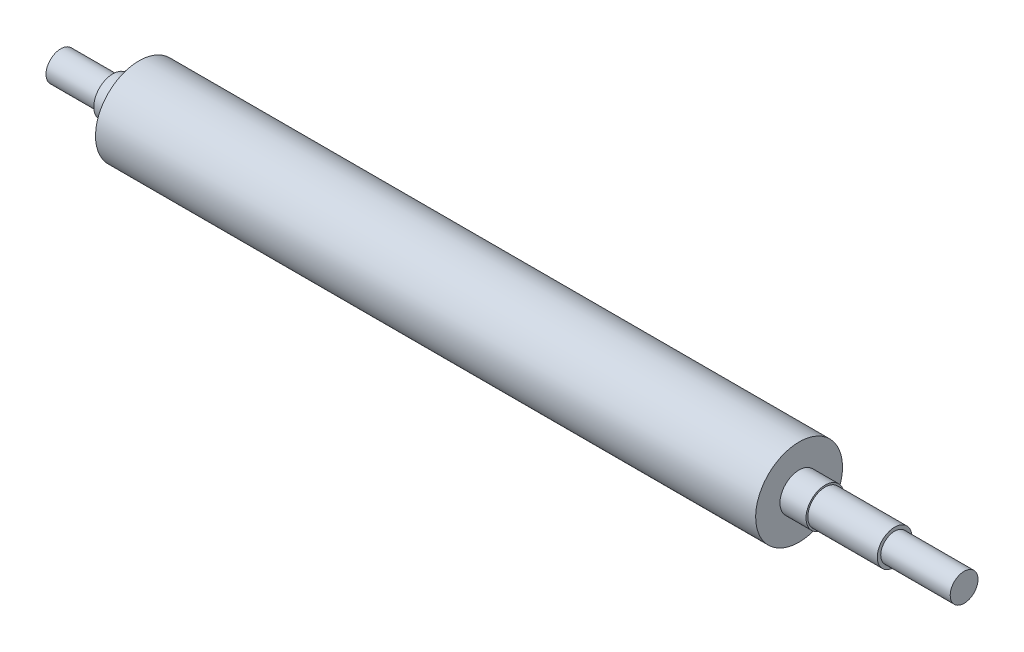
ISO-10303-21;
HEADER;
FILE_DESCRIPTION(('STEP AP214'),'2;1');
FILE_NAME('part.step','',(''),(''),'','','');
FILE_SCHEMA(('AUTOMOTIVE_DESIGN { 1 0 10303 214 1 1 1 1 }'));
ENDSEC;
DATA;
#1=APPLICATION_CONTEXT('core data for automotive mechanical design processes');
#2=APPLICATION_PROTOCOL_DEFINITION('international standard','automotive_design',2000,#1);
#3=PRODUCT_CONTEXT('',#1,'mechanical');
#4=PRODUCT('Part','Part','',(#3));
#5=PRODUCT_RELATED_PRODUCT_CATEGORY('part','',(#4));
#6=PRODUCT_DEFINITION_FORMATION('','',#4);
#7=PRODUCT_DEFINITION_CONTEXT('part definition',#1,'design');
#8=PRODUCT_DEFINITION('design','',#6,#7);
#9=PRODUCT_DEFINITION_SHAPE('','',#8);
#10=(LENGTH_UNIT() NAMED_UNIT(*) SI_UNIT(.MILLI.,.METRE.));
#11=(NAMED_UNIT(*) PLANE_ANGLE_UNIT() SI_UNIT($,.RADIAN.));
#12=(NAMED_UNIT(*) SI_UNIT($,.STERADIAN.) SOLID_ANGLE_UNIT());
#13=UNCERTAINTY_MEASURE_WITH_UNIT(LENGTH_MEASURE(1.E-05),#10,'distance_accuracy_value','');
#14=(GEOMETRIC_REPRESENTATION_CONTEXT(3) GLOBAL_UNCERTAINTY_ASSIGNED_CONTEXT((#13)) GLOBAL_UNIT_ASSIGNED_CONTEXT((#10,
#11,#12)) REPRESENTATION_CONTEXT('',''));
#15=CARTESIAN_POINT('',(0.,0.,0.));
#16=DIRECTION('',(0.,0.,1.));
#17=DIRECTION('',(1.,0.,0.));
#18=AXIS2_PLACEMENT_3D('',#15,#16,#17);
#19=CARTESIAN_POINT('',(-235.,0.,0.));
#20=DIRECTION('',(-1.,0.,0.));
#21=DIRECTION('',(0.,-1.,0.));
#22=AXIS2_PLACEMENT_3D('',#19,#20,#21);
#23=CYLINDRICAL_SURFACE('',#22,10.0000000000001);
#24=CARTESIAN_POINT('',(205.,0.,0.));
#25=DIRECTION('',(-1.,0.,0.));
#26=DIRECTION('',(0.,-1.,0.));
#27=AXIS2_PLACEMENT_3D('',#24,#25,#26);
#28=CIRCLE('',#27,10.0000000000001);
#29=CARTESIAN_POINT('',(205.,-10.0000000000001,0.));
#30=VERTEX_POINT('',#29);
#31=EDGE_CURVE('E110',#30,#30,#28,.T.);
#32=ORIENTED_EDGE('',*,*,#31,.F.);
#33=EDGE_LOOP('',(#32));
#34=FACE_BOUND('',#33,.T.);
#35=CARTESIAN_POINT('',(245.,0.,0.));
#36=DIRECTION('',(-1.,0.,0.));
#37=DIRECTION('',(0.,-1.,0.));
#38=AXIS2_PLACEMENT_3D('',#35,#36,#37);
#39=CIRCLE('',#38,10.0000000000001);
#40=CARTESIAN_POINT('',(245.,-10.0000000000001,0.));
#41=VERTEX_POINT('',#40);
#42=EDGE_CURVE('E159',#41,#41,#39,.T.);
#43=ORIENTED_EDGE('',*,*,#42,.T.);
#44=EDGE_LOOP('',(#43));
#45=FACE_BOUND('',#44,.T.);
#46=ADVANCED_FACE('F39',(#34,#45),#23,.T.);
#47=CARTESIAN_POINT('',(245.,10.0000000000001,0.));
#48=DIRECTION('',(-1.,0.,0.));
#49=DIRECTION('',(0.,-1.,0.));
#50=AXIS2_PLACEMENT_3D('',#47,#48,#49);
#51=PLANE('',#50);
#52=ORIENTED_EDGE('',*,*,#42,.F.);
#53=EDGE_LOOP('',(#52));
#54=FACE_BOUND('',#53,.T.);
#55=CARTESIAN_POINT('',(245.,0.,0.));
#56=DIRECTION('',(-1.,0.,0.));
#57=DIRECTION('',(0.,-1.,0.));
#58=AXIS2_PLACEMENT_3D('',#55,#56,#57);
#59=CIRCLE('',#58,8.);
#60=CARTESIAN_POINT('',(245.,-8.,0.));
#61=VERTEX_POINT('',#60);
#62=EDGE_CURVE('E155',#61,#61,#59,.T.);
#63=ORIENTED_EDGE('',*,*,#62,.T.);
#64=EDGE_LOOP('',(#63));
#65=FACE_BOUND('',#64,.T.);
#66=ADVANCED_FACE('F234',(#54,#65),#51,.F.);
#67=CARTESIAN_POINT('',(-235.,0.,0.));
#68=DIRECTION('',(-1.,0.,0.));
#69=DIRECTION('',(0.,-1.,0.));
#70=AXIS2_PLACEMENT_3D('',#67,#68,#69);
#71=CYLINDRICAL_SURFACE('',#70,8.);
#72=DIRECTION('',(-1.,0.,0.));
#73=VECTOR('',#72,1.);
#74=CARTESIAN_POINT('',(-235.,-7.41619848709564,-3.00000000000006));
#75=LINE('',#74,#73);
#76=CARTESIAN_POINT('',(250.,-7.41619848709564,-3.00000000000006));
#77=VERTEX_POINT('',#76);
#78=CARTESIAN_POINT('',(280.,-7.41619848709564,-3.00000000000006));
#79=VERTEX_POINT('',#78);
#80=EDGE_CURVE('E11',#77,#79,#75,.F.);
#81=ORIENTED_EDGE('',*,*,#80,.F.);
#82=CARTESIAN_POINT('',(250.,-7.41619848709564,-3.00000000000006));
#83=CARTESIAN_POINT('',(249.918837555012,-7.41618329421385,-3.00001150247647));
#84=CARTESIAN_POINT('',(249.837683450061,-7.41753047889668,-2.9967066173563));
#85=CARTESIAN_POINT('',(249.676019617705,-7.42283625204764,-2.98355385410622));
#86=CARTESIAN_POINT('',(249.595509683128,-7.42679396371771,-2.97370817282648));
#87=CARTESIAN_POINT('',(249.435989649364,-7.43718913494997,-2.9476097988831));
#88=CARTESIAN_POINT('',(249.356975247266,-7.44361776009883,-2.93137992723333));
#89=CARTESIAN_POINT('',(249.20072757264,-7.45873846840474,-2.89268899794152));
#90=CARTESIAN_POINT('',(249.123494390916,-7.4674306666777,-2.87022762338739));
#91=CARTESIAN_POINT('',(248.895386572167,-7.49650104432072,-2.79382748302793));
#92=CARTESIAN_POINT('',(248.747818987316,-7.51989303640962,-2.73082546455872));
#93=CARTESIAN_POINT('',(248.465300287699,-7.57204865479854,-2.58267582298611));
#94=CARTESIAN_POINT('',(248.330359622463,-7.60081667210071,-2.49751007462128));
#95=CARTESIAN_POINT('',(248.070225495052,-7.66207154206043,-2.30293382930718));
#96=CARTESIAN_POINT('',(247.945742475663,-7.69466741280603,-2.19260586782626));
#97=CARTESIAN_POINT('',(247.716550309181,-7.75899570966099,-1.9527886998884));
#98=CARTESIAN_POINT('',(247.611844989759,-7.7907279676163,-1.82329579298122));
#99=CARTESIAN_POINT('',(247.421720276261,-7.85105785862139,-1.54338757171277));
#100=CARTESIAN_POINT('',(247.337078987434,-7.87951196244674,-1.39240997283595));
#101=CARTESIAN_POINT('',(247.194695989104,-7.92876071159695,-1.07710720930449));
#102=CARTESIAN_POINT('',(247.136944250488,-7.94955821203215,-0.912787047982235));
#103=CARTESIAN_POINT('',(247.052484610716,-7.98037380796759,-0.58298011001187));
#104=CARTESIAN_POINT('',(247.024545247854,-7.99081812162104,-0.417849300032766));
#105=CARTESIAN_POINT('',(246.996557587679,-8.00128028076469,-0.0849316755534519));
#106=CARTESIAN_POINT('',(246.996500708907,-8.0013013342463,0.0828543058596256));
#107=CARTESIAN_POINT('',(247.023563629082,-7.99118528299379,0.40748820226102));
#108=CARTESIAN_POINT('',(247.049339000397,-7.98155070187544,0.56446657549835));
#109=CARTESIAN_POINT('',(247.125072492239,-7.95386524687798,0.871680542257373));
#110=CARTESIAN_POINT('',(247.175031985972,-7.93581389508571,1.02191575236401));
#111=CARTESIAN_POINT('',(247.298340971181,-7.89275540648328,1.31397787173874));
#112=CARTESIAN_POINT('',(247.372020379767,-7.86765083491918,1.45565053647599));
#113=CARTESIAN_POINT('',(247.540383376999,-7.8130263042928,1.72497274825266));
#114=CARTESIAN_POINT('',(247.635073796639,-7.78350491027406,1.85261771444891));
#115=CARTESIAN_POINT('',(247.849249022252,-7.72105277880022,2.0981725570586));
#116=CARTESIAN_POINT('',(247.9698593461,-7.68802362154427,2.21507771422329));
#117=CARTESIAN_POINT('',(248.229157687177,-7.62365399937982,2.42739237334714));
#118=CARTESIAN_POINT('',(248.367852776117,-7.59231420187513,2.5227934265));
#119=CARTESIAN_POINT('',(248.663556528403,-7.53423615367639,2.69136811228862));
#120=CARTESIAN_POINT('',(248.820909467739,-7.50761852023582,2.76398796570966));
#121=CARTESIAN_POINT('',(249.065094258959,-7.47445645209121,2.85192253834707));
#122=CARTESIAN_POINT('',(249.147830051979,-7.46453121139932,2.87773161974411));
#123=CARTESIAN_POINT('',(249.315465728326,-7.44725807921767,2.92214252998083));
#124=CARTESIAN_POINT('',(249.400364616494,-7.43990902469482,2.94074761150273));
#125=CARTESIAN_POINT('',(249.570735262701,-7.42813167576347,2.97037457126441));
#126=CARTESIAN_POINT('',(249.656191278976,-7.42367309574557,2.98147513434601));
#127=CARTESIAN_POINT('',(249.827761505356,-7.41769829849116,2.99629160882997));
#128=CARTESIAN_POINT('',(249.913875028841,-7.41617934660601,3.00001438364694));
#129=CARTESIAN_POINT('',(250.,-7.41619848709569,2.99999999999994));
#130=B_SPLINE_CURVE_WITH_KNOTS('',3,(#82,#83,#84,#85,#86,#87,#88,#89,#90,#91,#92,#93,#94,#95,
#96,#97,#98,#99,#100,#101,#102,#103,#104,#105,#106,#107,#108,#109,#110,#111,#112,#113,#114,#115,
#116,#117,#118,#119,#120,#121,#122,#123,#124,#125,#126,#127,#128,#129),.UNSPECIFIED.,.F.,.F.,(4,
2,2,2,2,2,2,2,2,2,2,2,2,2,2,2,2,2,2,2,2,2,2,4),(0.,0.243394931332342,0.486708155172818,
0.729159418642507,0.971623014582996,1.45569332924433,1.94016076226286,2.44639743378841,
2.95273197950298,3.47630767422024,3.9996879318651,4.50049538938436,5.00114871211392,
5.47703219828147,5.95294270890935,6.43578138823395,6.91877727629378,7.42999676443292,
7.94141675825194,8.46444709431861,8.72585166683365,8.98713807440332,9.24564054700924,
9.5039024266378),.UNSPECIFIED.);
#131=CARTESIAN_POINT('',(250.,-7.41619848709569,2.99999999999994));
#132=VERTEX_POINT('',#131);
#133=EDGE_CURVE('E163',#77,#132,#130,.T.);
#134=ORIENTED_EDGE('',*,*,#133,.T.);
#135=DIRECTION('',(-1.,0.,0.));
#136=VECTOR('',#135,1.);
#137=CARTESIAN_POINT('',(-235.,-7.41619848709569,2.99999999999994));
#138=LINE('',#137,#136);
#139=CARTESIAN_POINT('',(280.,-7.41619848709569,2.99999999999994));
#140=VERTEX_POINT('',#139);
#141=EDGE_CURVE('E47',#132,#140,#138,.F.);
#142=ORIENTED_EDGE('',*,*,#141,.T.);
#143=CARTESIAN_POINT('',(280.,-7.41619848709569,2.99999999999994));
#144=CARTESIAN_POINT('',(280.081162444988,-7.4161832942139,3.00001150247634));
#145=CARTESIAN_POINT('',(280.162316549939,-7.41753047889673,2.99670661735617));
#146=CARTESIAN_POINT('',(280.323980382295,-7.42283625204769,2.98355385410609));
#147=CARTESIAN_POINT('',(280.404490316872,-7.42679396371776,2.97370817282636));
#148=CARTESIAN_POINT('',(280.564010350636,-7.43718913495002,2.94760979888298));
#149=CARTESIAN_POINT('',(280.643024752734,-7.44361776009888,2.9313799272332));
#150=CARTESIAN_POINT('',(280.79927242736,-7.45873846840479,2.89268899794139));
#151=CARTESIAN_POINT('',(280.876505609084,-7.46743066667775,2.87022762338725));
#152=CARTESIAN_POINT('',(281.104613427834,-7.49650104432077,2.79382748302779));
#153=CARTESIAN_POINT('',(281.252181012685,-7.51989303640967,2.73082546455858));
#154=CARTESIAN_POINT('',(281.534699712301,-7.57204865479859,2.58267582298596));
#155=CARTESIAN_POINT('',(281.669640377537,-7.60081667210076,2.49751007462113));
#156=CARTESIAN_POINT('',(281.929774504948,-7.66207154206048,2.30293382930703));
#157=CARTESIAN_POINT('',(282.054257524337,-7.69466741280606,2.19260586782613));
#158=CARTESIAN_POINT('',(282.283449690819,-7.75899570966102,1.95278869988827));
#159=CARTESIAN_POINT('',(282.388155010241,-7.79072796761634,1.82329579298109));
#160=CARTESIAN_POINT('',(282.578279723739,-7.85105785862142,1.54338757171262));
#161=CARTESIAN_POINT('',(282.662921012567,-7.87951196244676,1.39240997283579));
#162=CARTESIAN_POINT('',(282.805304010896,-7.92876071159697,1.07710720930432));
#163=CARTESIAN_POINT('',(282.863055749512,-7.94955821203217,0.91278704798206));
#164=CARTESIAN_POINT('',(282.947515389284,-7.98037380796761,0.582980110011687));
#165=CARTESIAN_POINT('',(282.975454752146,-7.99081812162105,0.417849300032584));
#166=CARTESIAN_POINT('',(283.003442412321,-8.00128028076469,0.0849316755532768));
#167=CARTESIAN_POINT('',(283.003499291093,-8.0013013342463,-0.0828543058597944));
#168=CARTESIAN_POINT('',(282.976436370918,-7.99118528299379,-0.407488202261183));
#169=CARTESIAN_POINT('',(282.950660999603,-7.98155070187543,-0.564466575498514));
#170=CARTESIAN_POINT('',(282.874927507761,-7.95386524687796,-0.871680542257533));
#171=CARTESIAN_POINT('',(282.824968014028,-7.93581389508569,-1.02191575236417));
#172=CARTESIAN_POINT('',(282.701659028819,-7.89275540648325,-1.31397787173889));
#173=CARTESIAN_POINT('',(282.627979620233,-7.86765083491915,-1.45565053647615));
#174=CARTESIAN_POINT('',(282.459616623001,-7.81302630429277,-1.72497274825282));
#175=CARTESIAN_POINT('',(282.36492620336,-7.78350491027402,-1.85261771444908));
#176=CARTESIAN_POINT('',(282.150750977748,-7.72105277880018,-2.09817255705875));
#177=CARTESIAN_POINT('',(282.0301406539,-7.68802362154422,-2.21507771422343));
#178=CARTESIAN_POINT('',(281.770842312823,-7.62365399937977,-2.42739237334728));
#179=CARTESIAN_POINT('',(281.632147223883,-7.59231420187509,-2.52279342650013));
#180=CARTESIAN_POINT('',(281.336443471597,-7.53423615367635,-2.69136811228875));
#181=CARTESIAN_POINT('',(281.179090532261,-7.50761852023577,-2.7639879657098));
#182=CARTESIAN_POINT('',(280.934905741041,-7.47445645209116,-2.85192253834722));
#183=CARTESIAN_POINT('',(280.852169948021,-7.46453121139927,-2.87773161974426));
#184=CARTESIAN_POINT('',(280.684534271674,-7.44725807921762,-2.92214252998097));
#185=CARTESIAN_POINT('',(280.599635383506,-7.43990902469476,-2.94074761150288));
#186=CARTESIAN_POINT('',(280.429264737299,-7.42813167576342,-2.97037457126455));
#187=CARTESIAN_POINT('',(280.343808721024,-7.42367309574551,-2.98147513434615));
#188=CARTESIAN_POINT('',(280.172238494644,-7.41769829849111,-2.9962916088301));
#189=CARTESIAN_POINT('',(280.086124971159,-7.41617934660596,-3.00001438364707));
#190=CARTESIAN_POINT('',(280.,-7.41619848709564,-3.00000000000006));
#191=B_SPLINE_CURVE_WITH_KNOTS('',3,(#143,#144,#145,#146,#147,#148,#149,#150,#151,#152,#153,
#154,#155,#156,#157,#158,#159,#160,#161,#162,#163,#164,#165,#166,#167,#168,#169,#170,#171,#172,
#173,#174,#175,#176,#177,#178,#179,#180,#181,#182,#183,#184,#185,#186,#187,#188,#189,#190),
.UNSPECIFIED.,.F.,.F.,(4,2,2,2,2,2,2,2,2,2,2,2,2,2,2,2,2,2,2,2,2,2,2,4),(0.,0.243394931332342,
0.486708155172818,0.729159418642479,0.971623014583026,1.45569332924436,1.94016076226287,
2.44639743378843,2.95273197950296,3.47630767422026,3.99968793186515,4.5004953893844,
5.00114871211395,5.47703219828149,5.95294270890939,6.43578138823398,6.91877727629383,
7.4299967644329,7.94141675825198,8.46444709431862,8.72585166683372,8.98713807440342,
9.24564054700927,9.5039024266378),.UNSPECIFIED.);
#192=EDGE_CURVE('E54',#140,#79,#191,.T.);
#193=ORIENTED_EDGE('',*,*,#192,.T.);
#194=EDGE_LOOP('',(#81,#134,#142,#193));
#195=FACE_BOUND('',#194,.T.);
#196=ORIENTED_EDGE('',*,*,#62,.F.);
#197=EDGE_LOOP('',(#196));
#198=FACE_BOUND('',#197,.T.);
#199=CARTESIAN_POINT('',(285.,0.,0.));
#200=DIRECTION('',(-1.,0.,0.));
#201=DIRECTION('',(0.,-1.,0.));
#202=AXIS2_PLACEMENT_3D('',#199,#200,#201);
#203=CIRCLE('',#202,8.);
#204=CARTESIAN_POINT('',(285.,-8.,0.));
#205=VERTEX_POINT('',#204);
#206=EDGE_CURVE('E151',#205,#205,#203,.T.);
#207=ORIENTED_EDGE('',*,*,#206,.T.);
#208=EDGE_LOOP('',(#207));
#209=FACE_BOUND('',#208,.T.);
#210=ADVANCED_FACE('F178',(#195,#198,#209),#71,.T.);
#211=CARTESIAN_POINT('',(285.,8.,0.));
#212=DIRECTION('',(-1.,0.,0.));
#213=DIRECTION('',(0.,-1.,0.));
#214=AXIS2_PLACEMENT_3D('',#211,#212,#213);
#215=PLANE('',#214);
#216=ORIENTED_EDGE('',*,*,#206,.F.);
#217=EDGE_LOOP('',(#216));
#218=FACE_BOUND('',#217,.T.);
#219=ADVANCED_FACE('F227',(#218),#215,.F.);
#220=CARTESIAN_POINT('',(-235.,8.5,0.));
#221=DIRECTION('',(1.,0.,0.));
#222=DIRECTION('',(0.,1.,0.));
#223=AXIS2_PLACEMENT_3D('',#220,#221,#222);
#224=PLANE('',#223);
#225=CARTESIAN_POINT('',(-235.,0.,0.));
#226=DIRECTION('',(-1.,0.,0.));
#227=DIRECTION('',(0.,-1.,0.));
#228=AXIS2_PLACEMENT_3D('',#225,#226,#227);
#229=CIRCLE('',#228,8.5);
#230=CARTESIAN_POINT('',(-235.,-8.5,0.));
#231=VERTEX_POINT('',#230);
#232=EDGE_CURVE('E147',#231,#231,#229,.T.);
#233=ORIENTED_EDGE('',*,*,#232,.T.);
#234=EDGE_LOOP('',(#233));
#235=FACE_BOUND('',#234,.T.);
#236=ADVANCED_FACE('F224',(#235),#224,.F.);
#237=CARTESIAN_POINT('',(-235.,0.,0.));
#238=DIRECTION('',(-1.,0.,0.));
#239=DIRECTION('',(0.,-1.,0.));
#240=AXIS2_PLACEMENT_3D('',#237,#238,#239);
#241=CYLINDRICAL_SURFACE('',#240,8.5);
#242=ORIENTED_EDGE('',*,*,#232,.F.);
#243=EDGE_LOOP('',(#242));
#244=FACE_BOUND('',#243,.T.);
#245=CARTESIAN_POINT('',(-205.,0.,0.));
#246=DIRECTION('',(-1.,0.,0.));
#247=DIRECTION('',(0.,-1.,0.));
#248=AXIS2_PLACEMENT_3D('',#245,#246,#247);
#249=CIRCLE('',#248,8.5);
#250=CARTESIAN_POINT('',(-205.,-8.5,0.));
#251=VERTEX_POINT('',#250);
#252=EDGE_CURVE('E143',#251,#251,#249,.T.);
#253=ORIENTED_EDGE('',*,*,#252,.T.);
#254=EDGE_LOOP('',(#253));
#255=FACE_BOUND('',#254,.T.);
#256=ADVANCED_FACE('F220',(#244,#255),#241,.T.);
#257=CARTESIAN_POINT('',(-205.,8.5,0.));
#258=DIRECTION('',(1.,0.,0.));
#259=DIRECTION('',(0.,1.,0.));
#260=AXIS2_PLACEMENT_3D('',#257,#258,#259);
#261=PLANE('',#260);
#262=ORIENTED_EDGE('',*,*,#252,.F.);
#263=EDGE_LOOP('',(#262));
#264=FACE_BOUND('',#263,.T.);
#265=CARTESIAN_POINT('',(-205.,0.,0.));
#266=DIRECTION('',(-1.,0.,0.));
#267=DIRECTION('',(0.,-1.,0.));
#268=AXIS2_PLACEMENT_3D('',#265,#266,#267);
#269=CIRCLE('',#268,11.);
#270=CARTESIAN_POINT('',(-205.,-11.,0.));
#271=VERTEX_POINT('',#270);
#272=EDGE_CURVE('E139',#271,#271,#269,.T.);
#273=ORIENTED_EDGE('',*,*,#272,.T.);
#274=EDGE_LOOP('',(#273));
#275=FACE_BOUND('',#274,.T.);
#276=ADVANCED_FACE('F216',(#264,#275),#261,.F.);
#277=CARTESIAN_POINT('',(-235.,0.,0.));
#278=DIRECTION('',(-1.,0.,0.));
#279=DIRECTION('',(0.,-1.,0.));
#280=AXIS2_PLACEMENT_3D('',#277,#278,#279);
#281=CYLINDRICAL_SURFACE('',#280,11.);
#282=ORIENTED_EDGE('',*,*,#272,.F.);
#283=EDGE_LOOP('',(#282));
#284=FACE_BOUND('',#283,.T.);
#285=CARTESIAN_POINT('',(-190.,0.,0.));
#286=DIRECTION('',(-1.,0.,0.));
#287=DIRECTION('',(0.,-1.,0.));
#288=AXIS2_PLACEMENT_3D('',#285,#286,#287);
#289=CIRCLE('',#288,11.);
#290=CARTESIAN_POINT('',(-190.,-11.,0.));
#291=VERTEX_POINT('',#290);
#292=EDGE_CURVE('E135',#291,#291,#289,.T.);
#293=ORIENTED_EDGE('',*,*,#292,.T.);
#294=EDGE_LOOP('',(#293));
#295=FACE_BOUND('',#294,.T.);
#296=ADVANCED_FACE('F212',(#284,#295),#281,.T.);
#297=CARTESIAN_POINT('',(-190.,25.,0.));
#298=DIRECTION('',(1.,0.,0.));
#299=DIRECTION('',(0.,1.,0.));
#300=AXIS2_PLACEMENT_3D('',#297,#298,#299);
#301=PLANE('',#300);
#302=ORIENTED_EDGE('',*,*,#292,.F.);
#303=EDGE_LOOP('',(#302));
#304=FACE_BOUND('',#303,.T.);
#305=CARTESIAN_POINT('',(-190.,0.,0.));
#306=DIRECTION('',(-1.,0.,0.));
#307=DIRECTION('',(0.,-1.,0.));
#308=AXIS2_PLACEMENT_3D('',#305,#306,#307);
#309=CIRCLE('',#308,25.);
#310=CARTESIAN_POINT('',(-190.,-25.,0.));
#311=VERTEX_POINT('',#310);
#312=EDGE_CURVE('E131',#311,#311,#309,.T.);
#313=ORIENTED_EDGE('',*,*,#312,.T.);
#314=EDGE_LOOP('',(#313));
#315=FACE_BOUND('',#314,.T.);
#316=ADVANCED_FACE('F208',(#304,#315),#301,.F.);
#317=CARTESIAN_POINT('',(-235.,0.,0.));
#318=DIRECTION('',(-1.,0.,0.));
#319=DIRECTION('',(0.,-1.,0.));
#320=AXIS2_PLACEMENT_3D('',#317,#318,#319);
#321=CYLINDRICAL_SURFACE('',#320,25.);
#322=ORIENTED_EDGE('',*,*,#312,.F.);
#323=EDGE_LOOP('',(#322));
#324=FACE_BOUND('',#323,.T.);
#325=CARTESIAN_POINT('',(190.,0.,0.));
#326=DIRECTION('',(-1.,0.,0.));
#327=DIRECTION('',(0.,-1.,0.));
#328=AXIS2_PLACEMENT_3D('',#325,#326,#327);
#329=CIRCLE('',#328,25.);
#330=CARTESIAN_POINT('',(190.,-25.,0.));
#331=VERTEX_POINT('',#330);
#332=EDGE_CURVE('E127',#331,#331,#329,.T.);
#333=ORIENTED_EDGE('',*,*,#332,.T.);
#334=EDGE_LOOP('',(#333));
#335=FACE_BOUND('',#334,.T.);
#336=ADVANCED_FACE('F204',(#324,#335),#321,.T.);
#337=CARTESIAN_POINT('',(190.,25.,0.));
#338=DIRECTION('',(-1.,0.,0.));
#339=DIRECTION('',(0.,-1.,0.));
#340=AXIS2_PLACEMENT_3D('',#337,#338,#339);
#341=PLANE('',#340);
#342=ORIENTED_EDGE('',*,*,#332,.F.);
#343=EDGE_LOOP('',(#342));
#344=FACE_BOUND('',#343,.T.);
#345=CARTESIAN_POINT('',(190.,0.,0.));
#346=DIRECTION('',(-1.,0.,0.));
#347=DIRECTION('',(0.,-1.,0.));
#348=AXIS2_PLACEMENT_3D('',#345,#346,#347);
#349=CIRCLE('',#348,11.);
#350=CARTESIAN_POINT('',(190.,-11.,0.));
#351=VERTEX_POINT('',#350);
#352=EDGE_CURVE('E123',#351,#351,#349,.T.);
#353=ORIENTED_EDGE('',*,*,#352,.T.);
#354=EDGE_LOOP('',(#353));
#355=FACE_BOUND('',#354,.T.);
#356=ADVANCED_FACE('F200',(#344,#355),#341,.F.);
#357=CARTESIAN_POINT('',(-235.,0.,0.));
#358=DIRECTION('',(-1.,0.,0.));
#359=DIRECTION('',(0.,-1.,0.));
#360=AXIS2_PLACEMENT_3D('',#357,#358,#359);
#361=CYLINDRICAL_SURFACE('',#360,11.);
#362=ORIENTED_EDGE('',*,*,#352,.F.);
#363=EDGE_LOOP('',(#362));
#364=FACE_BOUND('',#363,.T.);
#365=CARTESIAN_POINT('',(205.,0.,0.));
#366=DIRECTION('',(-1.,0.,0.));
#367=DIRECTION('',(0.,-1.,0.));
#368=AXIS2_PLACEMENT_3D('',#365,#366,#367);
#369=CIRCLE('',#368,11.);
#370=CARTESIAN_POINT('',(205.,-11.,0.));
#371=VERTEX_POINT('',#370);
#372=EDGE_CURVE('E119',#371,#371,#369,.T.);
#373=ORIENTED_EDGE('',*,*,#372,.T.);
#374=EDGE_LOOP('',(#373));
#375=FACE_BOUND('',#374,.T.);
#376=ADVANCED_FACE('F196',(#364,#375),#361,.T.);
#377=CARTESIAN_POINT('',(205.,10.0000000000001,0.));
#378=DIRECTION('',(-1.,0.,0.));
#379=DIRECTION('',(0.,-1.,0.));
#380=AXIS2_PLACEMENT_3D('',#377,#378,#379);
#381=PLANE('',#380);
#382=ORIENTED_EDGE('',*,*,#372,.F.);
#383=EDGE_LOOP('',(#382));
#384=FACE_BOUND('',#383,.T.);
#385=ORIENTED_EDGE('',*,*,#31,.T.);
#386=EDGE_LOOP('',(#385));
#387=FACE_BOUND('',#386,.T.);
#388=ADVANCED_FACE('F193',(#384,#387),#381,.F.);
#389=CARTESIAN_POINT('',(280.,-4.5,0.));
#390=DIRECTION('',(0.,-1.,0.));
#391=DIRECTION('',(0.,0.,-1.));
#392=AXIS2_PLACEMENT_3D('',#389,#390,#391);
#393=CYLINDRICAL_SURFACE('',#392,3.);
#394=DIRECTION('',(0.,-1.,0.));
#395=VECTOR('',#394,1.);
#396=CARTESIAN_POINT('',(280.,-4.5,2.99999999999994));
#397=LINE('',#396,#395);
#398=CARTESIAN_POINT('',(280.,-4.5,2.99999999999994));
#399=VERTEX_POINT('',#398);
#400=EDGE_CURVE('E77',#399,#140,#397,.T.);
#401=ORIENTED_EDGE('',*,*,#400,.F.);
#402=CARTESIAN_POINT('',(280.,-4.5,0.));
#403=DIRECTION('',(0.,-1.,0.));
#404=DIRECTION('',(0.,0.,-1.));
#405=AXIS2_PLACEMENT_3D('',#402,#403,#404);
#406=CIRCLE('',#405,3.);
#407=CARTESIAN_POINT('',(280.,-4.5,-3.00000000000006));
#408=VERTEX_POINT('',#407);
#409=EDGE_CURVE('E81',#408,#399,#406,.T.);
#410=ORIENTED_EDGE('',*,*,#409,.F.);
#411=DIRECTION('',(0.,-1.,0.));
#412=VECTOR('',#411,1.);
#413=CARTESIAN_POINT('',(280.,-4.5,-3.00000000000006));
#414=LINE('',#413,#412);
#415=EDGE_CURVE('E107',#408,#79,#414,.T.);
#416=ORIENTED_EDGE('',*,*,#415,.T.);
#417=ORIENTED_EDGE('',*,*,#192,.F.);
#418=EDGE_LOOP('',(#401,#410,#416,#417));
#419=FACE_BOUND('',#418,.T.);
#420=ADVANCED_FACE('F79',(#419),#393,.F.);
#421=CARTESIAN_POINT('',(280.,-4.5,-3.00000000000006));
#422=DIRECTION('',(0.,0.,1.));
#423=DIRECTION('',(1.,0.,0.));
#424=AXIS2_PLACEMENT_3D('',#421,#422,#423);
#425=PLANE('',#424);
#426=ORIENTED_EDGE('',*,*,#80,.T.);
#427=ORIENTED_EDGE('',*,*,#415,.F.);
#428=DIRECTION('',(-1.,0.,0.));
#429=VECTOR('',#428,1.);
#430=CARTESIAN_POINT('',(280.,-4.5,-3.00000000000006));
#431=LINE('',#430,#429);
#432=CARTESIAN_POINT('',(250.,-4.5,-3.00000000000006));
#433=VERTEX_POINT('',#432);
#434=EDGE_CURVE('E86',#408,#433,#431,.T.);
#435=ORIENTED_EDGE('',*,*,#434,.T.);
#436=DIRECTION('',(0.,-1.,0.));
#437=VECTOR('',#436,1.);
#438=CARTESIAN_POINT('',(250.,-4.5,-3.00000000000006));
#439=LINE('',#438,#437);
#440=EDGE_CURVE('E111',#433,#77,#439,.T.);
#441=ORIENTED_EDGE('',*,*,#440,.T.);
#442=EDGE_LOOP('',(#426,#427,#435,#441));
#443=FACE_BOUND('',#442,.T.);
#444=ADVANCED_FACE('F186',(#443),#425,.T.);
#445=CARTESIAN_POINT('',(250.,-4.5,0.));
#446=DIRECTION('',(0.,-1.,0.));
#447=DIRECTION('',(0.,0.,-1.));
#448=AXIS2_PLACEMENT_3D('',#445,#446,#447);
#449=CYLINDRICAL_SURFACE('',#448,3.);
#450=ORIENTED_EDGE('',*,*,#440,.F.);
#451=CARTESIAN_POINT('',(250.,-4.5,0.));
#452=DIRECTION('',(0.,-1.,0.));
#453=DIRECTION('',(0.,0.,-1.));
#454=AXIS2_PLACEMENT_3D('',#451,#452,#453);
#455=CIRCLE('',#454,3.);
#456=CARTESIAN_POINT('',(250.,-4.5,2.99999999999994));
#457=VERTEX_POINT('',#456);
#458=EDGE_CURVE('E96',#457,#433,#455,.T.);
#459=ORIENTED_EDGE('',*,*,#458,.F.);
#460=DIRECTION('',(0.,-1.,0.));
#461=VECTOR('',#460,1.);
#462=CARTESIAN_POINT('',(250.,-4.5,2.99999999999994));
#463=LINE('',#462,#461);
#464=EDGE_CURVE('E85',#457,#132,#463,.T.);
#465=ORIENTED_EDGE('',*,*,#464,.T.);
#466=ORIENTED_EDGE('',*,*,#133,.F.);
#467=EDGE_LOOP('',(#450,#459,#465,#466));
#468=FACE_BOUND('',#467,.T.);
#469=ADVANCED_FACE('F181',(#468),#449,.F.);
#470=CARTESIAN_POINT('',(280.,-4.5,2.99999999999994));
#471=DIRECTION('',(0.,0.,1.));
#472=DIRECTION('',(1.,0.,0.));
#473=AXIS2_PLACEMENT_3D('',#470,#471,#472);
#474=PLANE('',#473);
#475=ORIENTED_EDGE('',*,*,#464,.F.);
#476=DIRECTION('',(-1.,0.,0.));
#477=VECTOR('',#476,1.);
#478=CARTESIAN_POINT('',(280.,-4.5,2.99999999999994));
#479=LINE('',#478,#477);
#480=EDGE_CURVE('E89',#399,#457,#479,.T.);
#481=ORIENTED_EDGE('',*,*,#480,.F.);
#482=ORIENTED_EDGE('',*,*,#400,.T.);
#483=ORIENTED_EDGE('',*,*,#141,.F.);
#484=EDGE_LOOP('',(#475,#481,#482,#483));
#485=FACE_BOUND('',#484,.T.);
#486=ADVANCED_FACE('F90',(#485),#474,.F.);
#487=CARTESIAN_POINT('',(280.,-4.5,0.));
#488=DIRECTION('',(0.,-1.,0.));
#489=DIRECTION('',(0.,0.,-1.));
#490=AXIS2_PLACEMENT_3D('',#487,#488,#489);
#491=PLANE('',#490);
#492=ORIENTED_EDGE('',*,*,#409,.T.);
#493=ORIENTED_EDGE('',*,*,#480,.T.);
#494=ORIENTED_EDGE('',*,*,#458,.T.);
#495=ORIENTED_EDGE('',*,*,#434,.F.);
#496=EDGE_LOOP('',(#492,#493,#494,#495));
#497=FACE_BOUND('',#496,.T.);
#498=ADVANCED_FACE('F99',(#497),#491,.T.);
#499=CLOSED_SHELL('',(#46,#66,#210,#219,#236,#256,#276,#296,#316,#336,#356,#376,#388,#420,#444,
#469,#486,#498));
#500=MANIFOLD_SOLID_BREP('B2',#499);
#501=ADVANCED_BREP_SHAPE_REPRESENTATION('',(#18,#500),#14);
#502=SHAPE_DEFINITION_REPRESENTATION(#9,#501);
ENDSEC;
END-ISO-10303-21;
